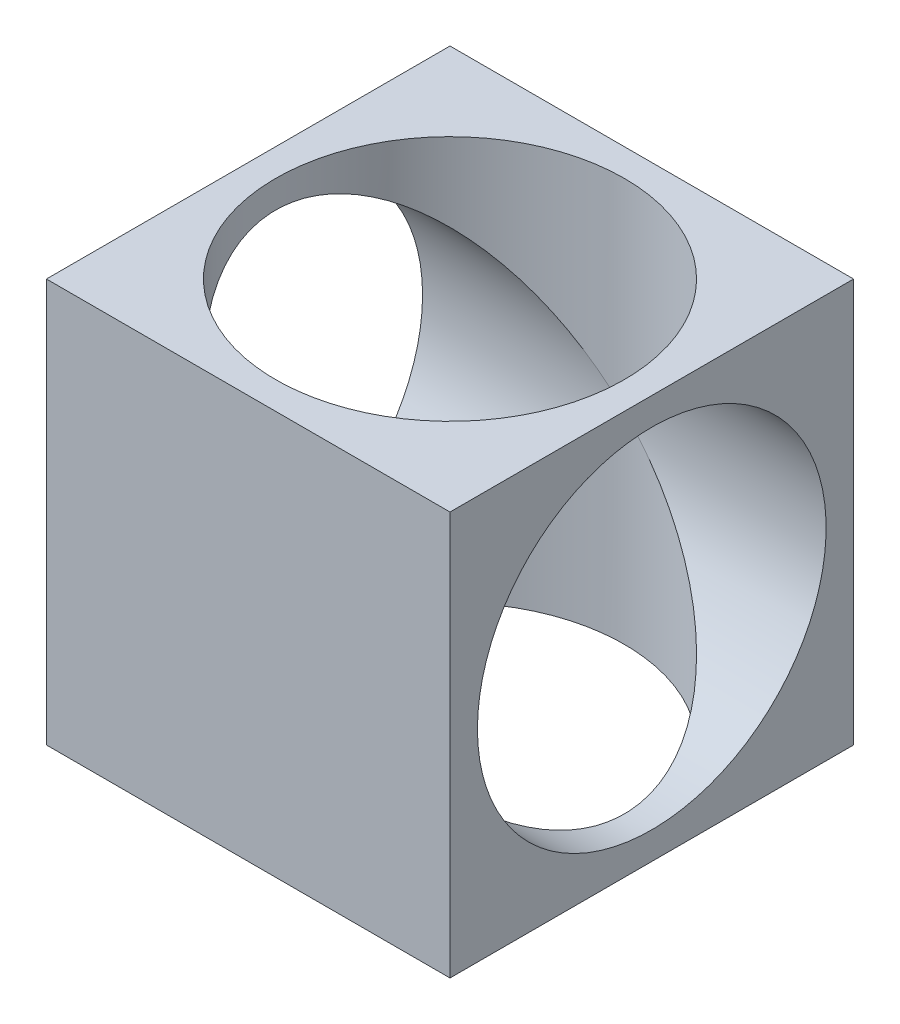
ISO-10303-21;
HEADER;
FILE_DESCRIPTION(('STEP AP214'),'2;1');
FILE_NAME('part.step','',(''),(''),'','','');
FILE_SCHEMA(('AUTOMOTIVE_DESIGN { 1 0 10303 214 1 1 1 1 }'));
ENDSEC;
DATA;
#1=APPLICATION_CONTEXT('core data for automotive mechanical design processes');
#2=APPLICATION_PROTOCOL_DEFINITION('international standard','automotive_design',2000,#1);
#3=PRODUCT_CONTEXT('',#1,'mechanical');
#4=PRODUCT('Part','Part','',(#3));
#5=PRODUCT_RELATED_PRODUCT_CATEGORY('part','',(#4));
#6=PRODUCT_DEFINITION_FORMATION('','',#4);
#7=PRODUCT_DEFINITION_CONTEXT('part definition',#1,'design');
#8=PRODUCT_DEFINITION('design','',#6,#7);
#9=PRODUCT_DEFINITION_SHAPE('','',#8);
#10=(LENGTH_UNIT() NAMED_UNIT(*) SI_UNIT(.MILLI.,.METRE.));
#11=(NAMED_UNIT(*) PLANE_ANGLE_UNIT() SI_UNIT($,.RADIAN.));
#12=(NAMED_UNIT(*) SI_UNIT($,.STERADIAN.) SOLID_ANGLE_UNIT());
#13=UNCERTAINTY_MEASURE_WITH_UNIT(LENGTH_MEASURE(1.E-05),#10,'distance_accuracy_value','');
#14=(GEOMETRIC_REPRESENTATION_CONTEXT(3) GLOBAL_UNCERTAINTY_ASSIGNED_CONTEXT((#13)) GLOBAL_UNIT_ASSIGNED_CONTEXT((#10,
#11,#12)) REPRESENTATION_CONTEXT('',''));
#15=CARTESIAN_POINT('',(0.,0.,0.));
#16=DIRECTION('',(0.,0.,1.));
#17=DIRECTION('',(1.,0.,0.));
#18=AXIS2_PLACEMENT_3D('',#15,#16,#17);
#19=CARTESIAN_POINT('',(0.,0.,0.));
#20=DIRECTION('',(0.,1.,0.));
#21=DIRECTION('',(0.,0.,1.));
#22=AXIS2_PLACEMENT_3D('',#19,#20,#21);
#23=CYLINDRICAL_SURFACE('',#22,13.716);
#24=CARTESIAN_POINT('',(0.,31.75,0.));
#25=DIRECTION('',(0.,-1.,0.));
#26=DIRECTION('',(0.,0.,-1.));
#27=AXIS2_PLACEMENT_3D('',#24,#25,#26);
#28=CIRCLE('',#27,13.716);
#29=CARTESIAN_POINT('',(0.,31.75,-13.716));
#30=VERTEX_POINT('',#29);
#31=EDGE_CURVE('E137',#30,#30,#28,.T.);
#32=ORIENTED_EDGE('',*,*,#31,.F.);
#33=EDGE_LOOP('',(#32));
#34=FACE_BOUND('',#33,.T.);
#35=CARTESIAN_POINT('',(0.,15.875,0.));
#36=DIRECTION('',(0.707106781186547,0.707106781186547,0.));
#37=DIRECTION('',(-0.707106781186547,0.707106781186547,0.));
#38=AXIS2_PLACEMENT_3D('',#35,#36,#37);
#39=ELLIPSE('',#38,19.3973532215094,13.716);
#40=CARTESIAN_POINT('',(0.,15.875,13.716));
#41=VERTEX_POINT('',#40);
#42=CARTESIAN_POINT('',(0.,15.875,-13.716));
#43=VERTEX_POINT('',#42);
#44=EDGE_CURVE('E52',#41,#43,#39,.F.);
#45=ORIENTED_EDGE('',*,*,#44,.T.);
#46=CARTESIAN_POINT('',(0.,15.875,0.));
#47=DIRECTION('',(-0.707106781186547,0.707106781186547,0.));
#48=DIRECTION('',(0.707106781186547,0.707106781186547,0.));
#49=AXIS2_PLACEMENT_3D('',#46,#47,#48);
#50=ELLIPSE('',#49,19.3973532215094,13.716);
#51=EDGE_CURVE('E11',#43,#41,#50,.F.);
#52=ORIENTED_EDGE('',*,*,#51,.T.);
#53=EDGE_LOOP('',(#45,#52));
#54=FACE_BOUND('',#53,.T.);
#55=ADVANCED_FACE('F38',(#34,#54),#23,.F.);
#56=CARTESIAN_POINT('',(15.875,31.75,15.875));
#57=DIRECTION('',(-1.,0.,0.));
#58=DIRECTION('',(0.,0.,1.));
#59=AXIS2_PLACEMENT_3D('',#56,#57,#58);
#60=PLANE('',#59);
#61=CARTESIAN_POINT('',(15.875,15.875,0.));
#62=DIRECTION('',(-1.,0.,0.));
#63=DIRECTION('',(0.,0.,1.));
#64=AXIS2_PLACEMENT_3D('',#61,#62,#63);
#65=CIRCLE('',#64,13.716);
#66=CARTESIAN_POINT('',(15.875,15.875,13.716));
#67=VERTEX_POINT('',#66);
#68=EDGE_CURVE('E158',#67,#67,#65,.T.);
#69=ORIENTED_EDGE('',*,*,#68,.T.);
#70=EDGE_LOOP('',(#69));
#71=FACE_BOUND('',#70,.T.);
#72=DIRECTION('',(0.,0.,-1.));
#73=VECTOR('',#72,1.);
#74=CARTESIAN_POINT('',(15.875,0.,15.875));
#75=LINE('',#74,#73);
#76=CARTESIAN_POINT('',(15.875,0.,15.875));
#77=VERTEX_POINT('',#76);
#78=CARTESIAN_POINT('',(15.875,0.,-15.875));
#79=VERTEX_POINT('',#78);
#80=EDGE_CURVE('E133',#77,#79,#75,.T.);
#81=ORIENTED_EDGE('',*,*,#80,.T.);
#82=DIRECTION('',(0.,-1.,0.));
#83=VECTOR('',#82,1.);
#84=CARTESIAN_POINT('',(15.875,31.75,-15.875));
#85=LINE('',#84,#83);
#86=CARTESIAN_POINT('',(15.875,31.75,-15.875));
#87=VERTEX_POINT('',#86);
#88=EDGE_CURVE('E106',#87,#79,#85,.T.);
#89=ORIENTED_EDGE('',*,*,#88,.F.);
#90=DIRECTION('',(0.,0.,-1.));
#91=VECTOR('',#90,1.);
#92=CARTESIAN_POINT('',(15.875,31.75,15.875));
#93=LINE('',#92,#91);
#94=CARTESIAN_POINT('',(15.875,31.75,15.875));
#95=VERTEX_POINT('',#94);
#96=EDGE_CURVE('E126',#95,#87,#93,.T.);
#97=ORIENTED_EDGE('',*,*,#96,.F.);
#98=DIRECTION('',(0.,-1.,0.));
#99=VECTOR('',#98,1.);
#100=CARTESIAN_POINT('',(15.875,31.75,15.875));
#101=LINE('',#100,#99);
#102=EDGE_CURVE('E121',#95,#77,#101,.T.);
#103=ORIENTED_EDGE('',*,*,#102,.T.);
#104=EDGE_LOOP('',(#81,#89,#97,#103));
#105=FACE_BOUND('',#104,.T.);
#106=ADVANCED_FACE('F40',(#71,#105),#60,.F.);
#107=CARTESIAN_POINT('',(-15.875,31.75,-15.875));
#108=DIRECTION('',(0.,0.,1.));
#109=DIRECTION('',(1.,0.,0.));
#110=AXIS2_PLACEMENT_3D('',#107,#108,#109);
#111=PLANE('',#110);
#112=DIRECTION('',(-1.,0.,0.));
#113=VECTOR('',#112,1.);
#114=CARTESIAN_POINT('',(-15.875,0.,-15.875));
#115=LINE('',#114,#113);
#116=CARTESIAN_POINT('',(-15.875,0.,-15.875));
#117=VERTEX_POINT('',#116);
#118=EDGE_CURVE('E130',#79,#117,#115,.T.);
#119=ORIENTED_EDGE('',*,*,#118,.T.);
#120=DIRECTION('',(0.,-1.,0.));
#121=VECTOR('',#120,1.);
#122=CARTESIAN_POINT('',(-15.875,31.75,-15.875));
#123=LINE('',#122,#121);
#124=CARTESIAN_POINT('',(-15.875,31.75,-15.875));
#125=VERTEX_POINT('',#124);
#126=EDGE_CURVE('E114',#125,#117,#123,.T.);
#127=ORIENTED_EDGE('',*,*,#126,.F.);
#128=DIRECTION('',(-1.,0.,0.));
#129=VECTOR('',#128,1.);
#130=CARTESIAN_POINT('',(-15.875,31.75,-15.875));
#131=LINE('',#130,#129);
#132=EDGE_CURVE('E90',#87,#125,#131,.T.);
#133=ORIENTED_EDGE('',*,*,#132,.F.);
#134=ORIENTED_EDGE('',*,*,#88,.T.);
#135=EDGE_LOOP('',(#119,#127,#133,#134));
#136=FACE_BOUND('',#135,.T.);
#137=ADVANCED_FACE('F176',(#136),#111,.F.);
#138=CARTESIAN_POINT('',(-15.875,31.75,15.875));
#139=DIRECTION('',(1.,0.,0.));
#140=DIRECTION('',(0.,0.,-1.));
#141=AXIS2_PLACEMENT_3D('',#138,#139,#140);
#142=PLANE('',#141);
#143=CARTESIAN_POINT('',(-15.875,15.875,0.));
#144=DIRECTION('',(1.,0.,0.));
#145=DIRECTION('',(0.,0.,-1.));
#146=AXIS2_PLACEMENT_3D('',#143,#144,#145);
#147=CIRCLE('',#146,13.716);
#148=CARTESIAN_POINT('',(-15.875,15.875,-13.716));
#149=VERTEX_POINT('',#148);
#150=EDGE_CURVE('E154',#149,#149,#147,.T.);
#151=ORIENTED_EDGE('',*,*,#150,.T.);
#152=EDGE_LOOP('',(#151));
#153=FACE_BOUND('',#152,.T.);
#154=DIRECTION('',(0.,0.,1.));
#155=VECTOR('',#154,1.);
#156=CARTESIAN_POINT('',(-15.875,0.,15.875));
#157=LINE('',#156,#155);
#158=CARTESIAN_POINT('',(-15.875,0.,15.875));
#159=VERTEX_POINT('',#158);
#160=EDGE_CURVE('E127',#117,#159,#157,.T.);
#161=ORIENTED_EDGE('',*,*,#160,.T.);
#162=DIRECTION('',(0.,-1.,0.));
#163=VECTOR('',#162,1.);
#164=CARTESIAN_POINT('',(-15.875,31.75,15.875));
#165=LINE('',#164,#163);
#166=CARTESIAN_POINT('',(-15.875,31.75,15.875));
#167=VERTEX_POINT('',#166);
#168=EDGE_CURVE('E118',#167,#159,#165,.T.);
#169=ORIENTED_EDGE('',*,*,#168,.F.);
#170=DIRECTION('',(0.,0.,1.));
#171=VECTOR('',#170,1.);
#172=CARTESIAN_POINT('',(-15.875,31.75,15.875));
#173=LINE('',#172,#171);
#174=EDGE_CURVE('E140',#125,#167,#173,.T.);
#175=ORIENTED_EDGE('',*,*,#174,.F.);
#176=ORIENTED_EDGE('',*,*,#126,.T.);
#177=EDGE_LOOP('',(#161,#169,#175,#176));
#178=FACE_BOUND('',#177,.T.);
#179=ADVANCED_FACE('F196',(#153,#178),#142,.F.);
#180=CARTESIAN_POINT('',(-15.875,31.75,15.875));
#181=DIRECTION('',(0.,0.,-1.));
#182=DIRECTION('',(-1.,0.,0.));
#183=AXIS2_PLACEMENT_3D('',#180,#181,#182);
#184=PLANE('',#183);
#185=DIRECTION('',(1.,0.,0.));
#186=VECTOR('',#185,1.);
#187=CARTESIAN_POINT('',(-15.875,0.,15.875));
#188=LINE('',#187,#186);
#189=EDGE_CURVE('E82',#159,#77,#188,.T.);
#190=ORIENTED_EDGE('',*,*,#189,.T.);
#191=ORIENTED_EDGE('',*,*,#102,.F.);
#192=DIRECTION('',(1.,0.,0.));
#193=VECTOR('',#192,1.);
#194=CARTESIAN_POINT('',(-15.875,31.75,15.875));
#195=LINE('',#194,#193);
#196=EDGE_CURVE('E61',#167,#95,#195,.T.);
#197=ORIENTED_EDGE('',*,*,#196,.F.);
#198=ORIENTED_EDGE('',*,*,#168,.T.);
#199=EDGE_LOOP('',(#190,#191,#197,#198));
#200=FACE_BOUND('',#199,.T.);
#201=ADVANCED_FACE('F190',(#200),#184,.F.);
#202=CARTESIAN_POINT('',(0.,31.75,0.));
#203=DIRECTION('',(0.,-1.,0.));
#204=DIRECTION('',(0.,0.,-1.));
#205=AXIS2_PLACEMENT_3D('',#202,#203,#204);
#206=PLANE('',#205);
#207=ORIENTED_EDGE('',*,*,#31,.T.);
#208=EDGE_LOOP('',(#207));
#209=FACE_BOUND('',#208,.T.);
#210=ORIENTED_EDGE('',*,*,#96,.T.);
#211=ORIENTED_EDGE('',*,*,#132,.T.);
#212=ORIENTED_EDGE('',*,*,#174,.T.);
#213=ORIENTED_EDGE('',*,*,#196,.T.);
#214=EDGE_LOOP('',(#210,#211,#212,#213));
#215=FACE_BOUND('',#214,.T.);
#216=ADVANCED_FACE('F184',(#209,#215),#206,.F.);
#217=CARTESIAN_POINT('',(0.,0.,0.));
#218=DIRECTION('',(0.,-1.,0.));
#219=DIRECTION('',(0.,0.,-1.));
#220=AXIS2_PLACEMENT_3D('',#217,#218,#219);
#221=PLANE('',#220);
#222=CARTESIAN_POINT('',(0.,0.,0.));
#223=DIRECTION('',(0.,1.,0.));
#224=DIRECTION('',(0.,0.,1.));
#225=AXIS2_PLACEMENT_3D('',#222,#223,#224);
#226=CIRCLE('',#225,13.716);
#227=CARTESIAN_POINT('',(0.,0.,13.716));
#228=VERTEX_POINT('',#227);
#229=EDGE_CURVE('E150',#228,#228,#226,.T.);
#230=ORIENTED_EDGE('',*,*,#229,.T.);
#231=EDGE_LOOP('',(#230));
#232=FACE_BOUND('',#231,.T.);
#233=ORIENTED_EDGE('',*,*,#80,.F.);
#234=ORIENTED_EDGE('',*,*,#189,.F.);
#235=ORIENTED_EDGE('',*,*,#160,.F.);
#236=ORIENTED_EDGE('',*,*,#118,.F.);
#237=EDGE_LOOP('',(#233,#234,#235,#236));
#238=FACE_BOUND('',#237,.T.);
#239=ADVANCED_FACE('F180',(#232,#238),#221,.T.);
#240=CARTESIAN_POINT('',(0.,15.875,0.));
#241=DIRECTION('',(0.707106781186547,0.707106781186547,0.));
#242=DIRECTION('',(-0.707106781186547,0.707106781186547,0.));
#243=AXIS2_PLACEMENT_3D('',#240,#241,#242);
#244=ELLIPSE('',#243,19.3973532215094,13.716);
#245=EDGE_CURVE('E96',#41,#43,#244,.T.);
#246=ORIENTED_EDGE('',*,*,#245,.T.);
#247=CARTESIAN_POINT('',(0.,15.875,0.));
#248=DIRECTION('',(-0.707106781186547,0.707106781186547,0.));
#249=DIRECTION('',(0.707106781186547,0.707106781186547,0.));
#250=AXIS2_PLACEMENT_3D('',#247,#248,#249);
#251=ELLIPSE('',#250,19.3973532215094,13.716);
#252=EDGE_CURVE('E47',#43,#41,#251,.T.);
#253=ORIENTED_EDGE('',*,*,#252,.T.);
#254=EDGE_LOOP('',(#246,#253));
#255=FACE_BOUND('',#254,.T.);
#256=ORIENTED_EDGE('',*,*,#229,.F.);
#257=EDGE_LOOP('',(#256));
#258=FACE_BOUND('',#257,.T.);
#259=ADVANCED_FACE('F108',(#255,#258),#23,.F.);
#260=CARTESIAN_POINT('',(15.875,15.875,0.));
#261=DIRECTION('',(-1.,0.,0.));
#262=DIRECTION('',(0.,0.,1.));
#263=AXIS2_PLACEMENT_3D('',#260,#261,#262);
#264=CYLINDRICAL_SURFACE('',#263,13.716);
#265=ORIENTED_EDGE('',*,*,#44,.F.);
#266=ORIENTED_EDGE('',*,*,#252,.F.);
#267=EDGE_LOOP('',(#265,#266));
#268=FACE_BOUND('',#267,.T.);
#269=ORIENTED_EDGE('',*,*,#150,.F.);
#270=EDGE_LOOP('',(#269));
#271=FACE_BOUND('',#270,.T.);
#272=ADVANCED_FACE('F103',(#268,#271),#264,.F.);
#273=ORIENTED_EDGE('',*,*,#68,.F.);
#274=EDGE_LOOP('',(#273));
#275=FACE_BOUND('',#274,.T.);
#276=ORIENTED_EDGE('',*,*,#245,.F.);
#277=ORIENTED_EDGE('',*,*,#51,.F.);
#278=EDGE_LOOP('',(#276,#277));
#279=FACE_BOUND('',#278,.T.);
#280=ADVANCED_FACE('F97',(#275,#279),#264,.F.);
#281=CLOSED_SHELL('',(#55,#106,#137,#179,#201,#216,#239,#259,#272,#280));
#282=MANIFOLD_SOLID_BREP('B2',#281);
#283=ADVANCED_BREP_SHAPE_REPRESENTATION('',(#18,#282),#14);
#284=SHAPE_DEFINITION_REPRESENTATION(#9,#283);
ENDSEC;
END-ISO-10303-21;
